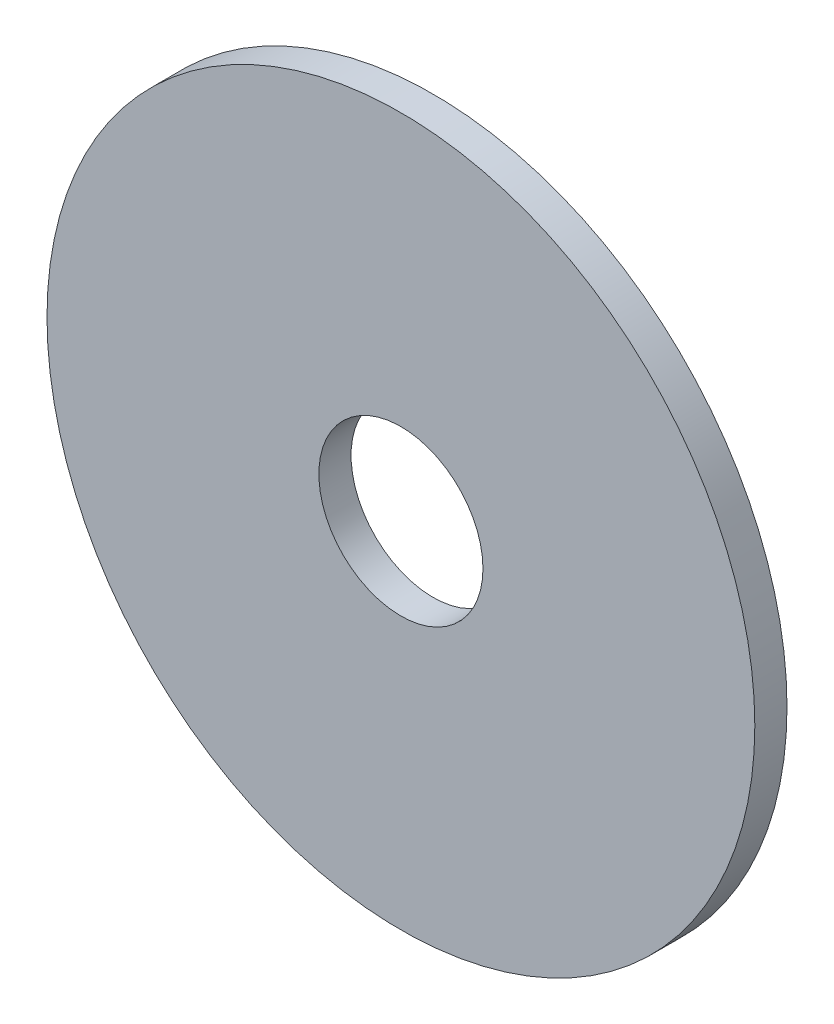
ISO-10303-21;
HEADER;
FILE_DESCRIPTION(('STEP AP214'),'2;1');
FILE_NAME('part.step','',(''),(''),'','','');
FILE_SCHEMA(('AUTOMOTIVE_DESIGN { 1 0 10303 214 1 1 1 1 }'));
ENDSEC;
DATA;
#1=APPLICATION_CONTEXT('core data for automotive mechanical design processes');
#2=APPLICATION_PROTOCOL_DEFINITION('international standard','automotive_design',2000,#1);
#3=PRODUCT_CONTEXT('',#1,'mechanical');
#4=PRODUCT('Part','Part','',(#3));
#5=PRODUCT_RELATED_PRODUCT_CATEGORY('part','',(#4));
#6=PRODUCT_DEFINITION_FORMATION('','',#4);
#7=PRODUCT_DEFINITION_CONTEXT('part definition',#1,'design');
#8=PRODUCT_DEFINITION('design','',#6,#7);
#9=PRODUCT_DEFINITION_SHAPE('','',#8);
#10=(LENGTH_UNIT() NAMED_UNIT(*) SI_UNIT(.MILLI.,.METRE.));
#11=(NAMED_UNIT(*) PLANE_ANGLE_UNIT() SI_UNIT($,.RADIAN.));
#12=(NAMED_UNIT(*) SI_UNIT($,.STERADIAN.) SOLID_ANGLE_UNIT());
#13=UNCERTAINTY_MEASURE_WITH_UNIT(LENGTH_MEASURE(1.E-05),#10,'distance_accuracy_value','');
#14=(GEOMETRIC_REPRESENTATION_CONTEXT(3) GLOBAL_UNCERTAINTY_ASSIGNED_CONTEXT((#13)) GLOBAL_UNIT_ASSIGNED_CONTEXT((#10,
#11,#12)) REPRESENTATION_CONTEXT('',''));
#15=CARTESIAN_POINT('',(0.,0.,0.));
#16=DIRECTION('',(0.,0.,1.));
#17=DIRECTION('',(1.,0.,0.));
#18=AXIS2_PLACEMENT_3D('',#15,#16,#17);
#19=CARTESIAN_POINT('',(0.,0.,10.));
#20=DIRECTION('',(0.,0.,1.));
#21=DIRECTION('',(1.,0.,0.));
#22=AXIS2_PLACEMENT_3D('',#19,#20,#21);
#23=PLANE('',#22);
#24=CARTESIAN_POINT('',(0.,0.,10.));
#25=DIRECTION('',(0.,0.,1.));
#26=DIRECTION('',(1.,0.,0.));
#27=AXIS2_PLACEMENT_3D('',#24,#25,#26);
#28=CIRCLE('',#27,110.);
#29=CARTESIAN_POINT('',(110.,0.,10.));
#30=VERTEX_POINT('',#29);
#31=EDGE_CURVE('E10',#30,#30,#28,.T.);
#32=ORIENTED_EDGE('',*,*,#31,.T.);
#33=EDGE_LOOP('',(#32));
#34=FACE_BOUND('',#33,.T.);
#35=CARTESIAN_POINT('',(0.,0.,10.));
#36=DIRECTION('',(0.,0.,1.));
#37=DIRECTION('',(1.,0.,0.));
#38=AXIS2_PLACEMENT_3D('',#35,#36,#37);
#39=CIRCLE('',#38,25.5);
#40=CARTESIAN_POINT('',(25.5,0.,10.));
#41=VERTEX_POINT('',#40);
#42=EDGE_CURVE('E41',#41,#41,#39,.T.);
#43=ORIENTED_EDGE('',*,*,#42,.F.);
#44=EDGE_LOOP('',(#43));
#45=FACE_BOUND('',#44,.T.);
#46=ADVANCED_FACE('F30',(#34,#45),#23,.T.);
#47=CARTESIAN_POINT('',(0.,0.,0.));
#48=DIRECTION('',(0.,0.,1.));
#49=DIRECTION('',(1.,0.,0.));
#50=AXIS2_PLACEMENT_3D('',#47,#48,#49);
#51=PLANE('',#50);
#52=CARTESIAN_POINT('',(0.,0.,0.));
#53=DIRECTION('',(0.,0.,1.));
#54=DIRECTION('',(1.,0.,0.));
#55=AXIS2_PLACEMENT_3D('',#52,#53,#54);
#56=CIRCLE('',#55,110.);
#57=CARTESIAN_POINT('',(110.,0.,0.));
#58=VERTEX_POINT('',#57);
#59=EDGE_CURVE('E34',#58,#58,#56,.T.);
#60=ORIENTED_EDGE('',*,*,#59,.F.);
#61=EDGE_LOOP('',(#60));
#62=FACE_BOUND('',#61,.T.);
#63=CARTESIAN_POINT('',(0.,0.,0.));
#64=DIRECTION('',(0.,0.,1.));
#65=DIRECTION('',(1.,0.,0.));
#66=AXIS2_PLACEMENT_3D('',#63,#64,#65);
#67=CIRCLE('',#66,25.5);
#68=CARTESIAN_POINT('',(25.5,0.,0.));
#69=VERTEX_POINT('',#68);
#70=EDGE_CURVE('E43',#69,#69,#67,.T.);
#71=ORIENTED_EDGE('',*,*,#70,.T.);
#72=EDGE_LOOP('',(#71));
#73=FACE_BOUND('',#72,.T.);
#74=ADVANCED_FACE('F53',(#62,#73),#51,.F.);
#75=CARTESIAN_POINT('',(0.,0.,10.));
#76=DIRECTION('',(0.,0.,-1.));
#77=DIRECTION('',(-1.,0.,0.));
#78=AXIS2_PLACEMENT_3D('',#75,#76,#77);
#79=CYLINDRICAL_SURFACE('',#78,110.);
#80=ORIENTED_EDGE('',*,*,#31,.F.);
#81=EDGE_LOOP('',(#80));
#82=FACE_BOUND('',#81,.T.);
#83=ORIENTED_EDGE('',*,*,#59,.T.);
#84=EDGE_LOOP('',(#83));
#85=FACE_BOUND('',#84,.T.);
#86=ADVANCED_FACE('F32',(#82,#85),#79,.T.);
#87=CARTESIAN_POINT('',(0.,0.,10.));
#88=DIRECTION('',(0.,0.,-1.));
#89=DIRECTION('',(-1.,0.,0.));
#90=AXIS2_PLACEMENT_3D('',#87,#88,#89);
#91=CYLINDRICAL_SURFACE('',#90,25.5);
#92=ORIENTED_EDGE('',*,*,#42,.T.);
#93=EDGE_LOOP('',(#92));
#94=FACE_BOUND('',#93,.T.);
#95=ORIENTED_EDGE('',*,*,#70,.F.);
#96=EDGE_LOOP('',(#95));
#97=FACE_BOUND('',#96,.T.);
#98=ADVANCED_FACE('F49',(#94,#97),#91,.F.);
#99=CLOSED_SHELL('',(#46,#74,#86,#98));
#100=MANIFOLD_SOLID_BREP('B2',#99);
#101=ADVANCED_BREP_SHAPE_REPRESENTATION('',(#18,#100),#14);
#102=SHAPE_DEFINITION_REPRESENTATION(#9,#101);
ENDSEC;
END-ISO-10303-21;
